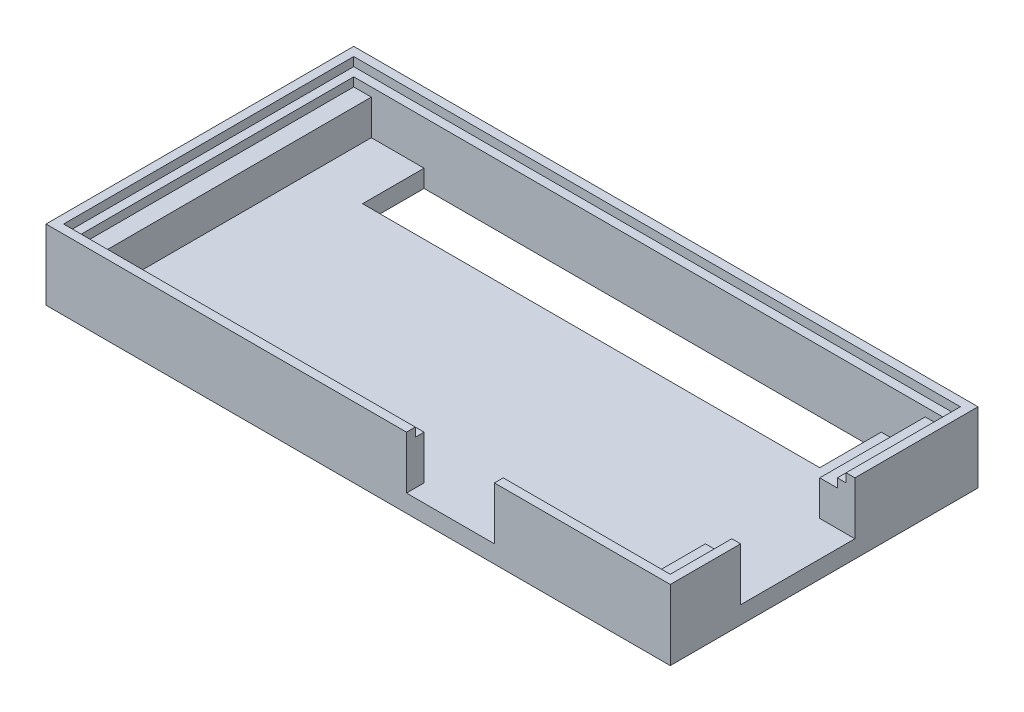
ISO-10303-21;
HEADER;
FILE_DESCRIPTION(('STEP AP214'),'2;1');
FILE_NAME('part.step','',(''),(''),'','','');
FILE_SCHEMA(('AUTOMOTIVE_DESIGN { 1 0 10303 214 1 1 1 1 }'));
ENDSEC;
DATA;
#1=APPLICATION_CONTEXT('core data for automotive mechanical design processes');
#2=APPLICATION_PROTOCOL_DEFINITION('international standard','automotive_design',2000,#1);
#3=PRODUCT_CONTEXT('',#1,'mechanical');
#4=PRODUCT('Part','Part','',(#3));
#5=PRODUCT_RELATED_PRODUCT_CATEGORY('part','',(#4));
#6=PRODUCT_DEFINITION_FORMATION('','',#4);
#7=PRODUCT_DEFINITION_CONTEXT('part definition',#1,'design');
#8=PRODUCT_DEFINITION('design','',#6,#7);
#9=PRODUCT_DEFINITION_SHAPE('','',#8);
#10=(LENGTH_UNIT() NAMED_UNIT(*) SI_UNIT(.MILLI.,.METRE.));
#11=(NAMED_UNIT(*) PLANE_ANGLE_UNIT() SI_UNIT($,.RADIAN.));
#12=(NAMED_UNIT(*) SI_UNIT($,.STERADIAN.) SOLID_ANGLE_UNIT());
#13=UNCERTAINTY_MEASURE_WITH_UNIT(LENGTH_MEASURE(1.E-05),#10,'distance_accuracy_value','');
#14=(GEOMETRIC_REPRESENTATION_CONTEXT(3) GLOBAL_UNCERTAINTY_ASSIGNED_CONTEXT((#13)) GLOBAL_UNIT_ASSIGNED_CONTEXT((#10,
#11,#12)) REPRESENTATION_CONTEXT('',''));
#15=CARTESIAN_POINT('',(0.,0.,0.));
#16=DIRECTION('',(0.,0.,1.));
#17=DIRECTION('',(1.,0.,0.));
#18=AXIS2_PLACEMENT_3D('',#15,#16,#17);
#19=CARTESIAN_POINT('',(0.,7.,0.));
#20=DIRECTION('',(0.,1.,0.));
#21=DIRECTION('',(0.,0.,1.));
#22=AXIS2_PLACEMENT_3D('',#19,#20,#21);
#23=PLANE('',#22);
#24=DIRECTION('',(-1.,0.,0.));
#25=VECTOR('',#24,1.);
#26=CARTESIAN_POINT('',(51.,7.,-1.));
#27=LINE('',#26,#25);
#28=CARTESIAN_POINT('',(70.,7.,-1.));
#29=VERTEX_POINT('',#28);
#30=CARTESIAN_POINT('',(51.,7.,-1.));
#31=VERTEX_POINT('',#30);
#32=EDGE_CURVE('E282',#29,#31,#27,.T.);
#33=ORIENTED_EDGE('',*,*,#32,.F.);
#34=DIRECTION('',(0.,0.,1.));
#35=VECTOR('',#34,1.);
#36=CARTESIAN_POINT('',(70.,7.,-1.));
#37=LINE('',#36,#35);
#38=CARTESIAN_POINT('',(70.,7.,-8.));
#39=VERTEX_POINT('',#38);
#40=EDGE_CURVE('E284',#39,#29,#37,.T.);
#41=ORIENTED_EDGE('',*,*,#40,.F.);
#42=DIRECTION('',(-1.,0.,0.));
#43=VECTOR('',#42,1.);
#44=CARTESIAN_POINT('',(71.,7.,-8.));
#45=LINE('',#44,#43);
#46=CARTESIAN_POINT('',(69.,7.,-8.));
#47=VERTEX_POINT('',#46);
#48=EDGE_CURVE('E373',#39,#47,#45,.T.);
#49=ORIENTED_EDGE('',*,*,#48,.T.);
#50=DIRECTION('',(0.,0.,-1.));
#51=VECTOR('',#50,1.);
#52=CARTESIAN_POINT('',(69.,7.,-2.));
#53=LINE('',#52,#51);
#54=CARTESIAN_POINT('',(69.,7.,-2.));
#55=VERTEX_POINT('',#54);
#56=EDGE_CURVE('E526',#55,#47,#53,.T.);
#57=ORIENTED_EDGE('',*,*,#56,.F.);
#58=DIRECTION('',(1.,0.,0.));
#59=VECTOR('',#58,1.);
#60=CARTESIAN_POINT('',(2.,7.,-2.));
#61=LINE('',#60,#59);
#62=CARTESIAN_POINT('',(51.,7.,-2.));
#63=VERTEX_POINT('',#62);
#64=EDGE_CURVE('E532',#63,#55,#61,.T.);
#65=ORIENTED_EDGE('',*,*,#64,.F.);
#66=DIRECTION('',(0.,0.,-1.));
#67=VECTOR('',#66,1.);
#68=CARTESIAN_POINT('',(51.,7.,0.));
#69=LINE('',#68,#67);
#70=EDGE_CURVE('E353',#31,#63,#69,.T.);
#71=ORIENTED_EDGE('',*,*,#70,.F.);
#72=EDGE_LOOP('',(#33,#41,#49,#57,#65,#71));
#73=FACE_BOUND('',#72,.T.);
#74=ADVANCED_FACE('F32',(#73),#23,.T.);
#75=DIRECTION('',(0.,0.,-1.));
#76=VECTOR('',#75,1.);
#77=CARTESIAN_POINT('',(1.,7.,-34.));
#78=LINE('',#77,#76);
#79=CARTESIAN_POINT('',(1.,7.,-1.));
#80=VERTEX_POINT('',#79);
#81=CARTESIAN_POINT('',(1.,7.,-34.));
#82=VERTEX_POINT('',#81);
#83=EDGE_CURVE('E58',#80,#82,#78,.T.);
#84=ORIENTED_EDGE('',*,*,#83,.F.);
#85=DIRECTION('',(-1.,0.,0.));
#86=VECTOR('',#85,1.);
#87=CARTESIAN_POINT('',(1.,7.,-1.));
#88=LINE('',#87,#86);
#89=CARTESIAN_POINT('',(41.,7.,-1.));
#90=VERTEX_POINT('',#89);
#91=EDGE_CURVE('E300',#90,#80,#88,.T.);
#92=ORIENTED_EDGE('',*,*,#91,.F.);
#93=DIRECTION('',(0.,0.,-1.));
#94=VECTOR('',#93,1.);
#95=CARTESIAN_POINT('',(41.,7.,0.));
#96=LINE('',#95,#94);
#97=CARTESIAN_POINT('',(41.,7.,-2.));
#98=VERTEX_POINT('',#97);
#99=EDGE_CURVE('E357',#90,#98,#96,.T.);
#100=ORIENTED_EDGE('',*,*,#99,.T.);
#101=CARTESIAN_POINT('',(2.,7.,-2.));
#102=VERTEX_POINT('',#101);
#103=EDGE_CURVE('E467',#102,#98,#61,.T.);
#104=ORIENTED_EDGE('',*,*,#103,.F.);
#105=DIRECTION('',(0.,0.,1.));
#106=VECTOR('',#105,1.);
#107=CARTESIAN_POINT('',(2.,7.,-33.));
#108=LINE('',#107,#106);
#109=CARTESIAN_POINT('',(2.,7.,-33.));
#110=VERTEX_POINT('',#109);
#111=EDGE_CURVE('E530',#110,#102,#108,.T.);
#112=ORIENTED_EDGE('',*,*,#111,.F.);
#113=DIRECTION('',(-1.,0.,0.));
#114=VECTOR('',#113,1.);
#115=CARTESIAN_POINT('',(69.,7.,-33.));
#116=LINE('',#115,#114);
#117=CARTESIAN_POINT('',(69.,7.,-33.));
#118=VERTEX_POINT('',#117);
#119=EDGE_CURVE('E529',#118,#110,#116,.T.);
#120=ORIENTED_EDGE('',*,*,#119,.F.);
#121=CARTESIAN_POINT('',(69.,7.,-21.));
#122=VERTEX_POINT('',#121);
#123=EDGE_CURVE('E473',#122,#118,#53,.T.);
#124=ORIENTED_EDGE('',*,*,#123,.F.);
#125=DIRECTION('',(-1.,0.,0.));
#126=VECTOR('',#125,1.);
#127=CARTESIAN_POINT('',(71.,7.,-21.));
#128=LINE('',#127,#126);
#129=CARTESIAN_POINT('',(70.,7.,-21.));
#130=VERTEX_POINT('',#129);
#131=EDGE_CURVE('E377',#130,#122,#128,.T.);
#132=ORIENTED_EDGE('',*,*,#131,.F.);
#133=DIRECTION('',(0.,0.,1.));
#134=VECTOR('',#133,1.);
#135=CARTESIAN_POINT('',(70.,7.,-21.));
#136=LINE('',#135,#134);
#137=CARTESIAN_POINT('',(70.,7.,-34.));
#138=VERTEX_POINT('',#137);
#139=EDGE_CURVE('E305',#138,#130,#136,.T.);
#140=ORIENTED_EDGE('',*,*,#139,.F.);
#141=DIRECTION('',(1.,0.,0.));
#142=VECTOR('',#141,1.);
#143=CARTESIAN_POINT('',(70.,7.,-34.));
#144=LINE('',#143,#142);
#145=EDGE_CURVE('E330',#82,#138,#144,.T.);
#146=ORIENTED_EDGE('',*,*,#145,.F.);
#147=EDGE_LOOP('',(#84,#92,#100,#104,#112,#120,#124,#132,#140,#146));
#148=FACE_BOUND('',#147,.T.);
#149=ADVANCED_FACE('F547',(#148),#23,.T.);
#150=CARTESIAN_POINT('',(2.,7.,-2.));
#151=DIRECTION('',(0.,0.,-1.));
#152=DIRECTION('',(-1.,0.,0.));
#153=AXIS2_PLACEMENT_3D('',#150,#151,#152);
#154=PLANE('',#153);
#155=DIRECTION('',(0.,1.,0.));
#156=VECTOR('',#155,1.);
#157=CARTESIAN_POINT('',(41.,2.,-2.));
#158=LINE('',#157,#156);
#159=CARTESIAN_POINT('',(41.,2.,-2.));
#160=VERTEX_POINT('',#159);
#161=EDGE_CURVE('E267',#160,#98,#158,.T.);
#162=ORIENTED_EDGE('',*,*,#161,.F.);
#163=DIRECTION('',(1.,0.,0.));
#164=VECTOR('',#163,1.);
#165=CARTESIAN_POINT('',(2.,2.,-2.));
#166=LINE('',#165,#164);
#167=CARTESIAN_POINT('',(4.,2.,-2.));
#168=VERTEX_POINT('',#167);
#169=EDGE_CURVE('E469',#168,#160,#166,.T.);
#170=ORIENTED_EDGE('',*,*,#169,.F.);
#171=DIRECTION('',(0.,-1.,0.));
#172=VECTOR('',#171,1.);
#173=CARTESIAN_POINT('',(4.,6.,-2.));
#174=LINE('',#173,#172);
#175=CARTESIAN_POINT('',(4.,6.,-2.));
#176=VERTEX_POINT('',#175);
#177=EDGE_CURVE('E436',#176,#168,#174,.T.);
#178=ORIENTED_EDGE('',*,*,#177,.F.);
#179=DIRECTION('',(1.,0.,0.));
#180=VECTOR('',#179,1.);
#181=CARTESIAN_POINT('',(4.,6.,-2.));
#182=LINE('',#181,#180);
#183=CARTESIAN_POINT('',(2.,6.,-2.));
#184=VERTEX_POINT('',#183);
#185=EDGE_CURVE('E426',#184,#176,#182,.T.);
#186=ORIENTED_EDGE('',*,*,#185,.F.);
#187=DIRECTION('',(0.,-1.,0.));
#188=VECTOR('',#187,1.);
#189=CARTESIAN_POINT('',(2.,7.,-2.));
#190=LINE('',#189,#188);
#191=EDGE_CURVE('E478',#102,#184,#190,.T.);
#192=ORIENTED_EDGE('',*,*,#191,.F.);
#193=ORIENTED_EDGE('',*,*,#103,.T.);
#194=EDGE_LOOP('',(#162,#170,#178,#186,#192,#193));
#195=FACE_BOUND('',#194,.T.);
#196=ADVANCED_FACE('F544',(#195),#154,.T.);
#197=CARTESIAN_POINT('',(69.,7.,-2.));
#198=DIRECTION('',(-1.,0.,0.));
#199=DIRECTION('',(0.,0.,1.));
#200=AXIS2_PLACEMENT_3D('',#197,#198,#199);
#201=PLANE('',#200);
#202=DIRECTION('',(0.,-1.,0.));
#203=VECTOR('',#202,1.);
#204=CARTESIAN_POINT('',(69.,2.,-21.));
#205=LINE('',#204,#203);
#206=CARTESIAN_POINT('',(69.,6.,-21.));
#207=VERTEX_POINT('',#206);
#208=EDGE_CURVE('E368',#122,#207,#205,.T.);
#209=ORIENTED_EDGE('',*,*,#208,.F.);
#210=ORIENTED_EDGE('',*,*,#123,.T.);
#211=DIRECTION('',(0.,-1.,0.));
#212=VECTOR('',#211,1.);
#213=CARTESIAN_POINT('',(69.,7.,-33.));
#214=LINE('',#213,#212);
#215=CARTESIAN_POINT('',(69.,6.,-33.));
#216=VERTEX_POINT('',#215);
#217=EDGE_CURVE('E484',#118,#216,#214,.T.);
#218=ORIENTED_EDGE('',*,*,#217,.T.);
#219=DIRECTION('',(0.,0.,-1.));
#220=VECTOR('',#219,1.);
#221=CARTESIAN_POINT('',(69.,6.,-21.));
#222=LINE('',#221,#220);
#223=EDGE_CURVE('E402',#207,#216,#222,.T.);
#224=ORIENTED_EDGE('',*,*,#223,.F.);
#225=EDGE_LOOP('',(#209,#210,#218,#224));
#226=FACE_BOUND('',#225,.T.);
#227=ADVANCED_FACE('F576',(#226),#201,.T.);
#228=CARTESIAN_POINT('',(0.,2.,0.));
#229=DIRECTION('',(0.,1.,0.));
#230=DIRECTION('',(0.,0.,1.));
#231=AXIS2_PLACEMENT_3D('',#228,#229,#230);
#232=PLANE('',#231);
#233=DIRECTION('',(0.,0.,1.));
#234=VECTOR('',#233,1.);
#235=CARTESIAN_POINT('',(67.,2.,-2.));
#236=LINE('',#235,#234);
#237=CARTESIAN_POINT('',(67.,2.,-8.));
#238=VERTEX_POINT('',#237);
#239=CARTESIAN_POINT('',(67.,2.,-2.));
#240=VERTEX_POINT('',#239);
#241=EDGE_CURVE('E385',#238,#240,#236,.T.);
#242=ORIENTED_EDGE('',*,*,#241,.F.);
#243=DIRECTION('',(-1.,0.,0.));
#244=VECTOR('',#243,1.);
#245=CARTESIAN_POINT('',(67.,2.,-8.));
#246=LINE('',#245,#244);
#247=CARTESIAN_POINT('',(71.,2.,-8.));
#248=VERTEX_POINT('',#247);
#249=EDGE_CURVE('E379',#248,#238,#246,.T.);
#250=ORIENTED_EDGE('',*,*,#249,.F.);
#251=DIRECTION('',(0.,0.,1.));
#252=VECTOR('',#251,1.);
#253=CARTESIAN_POINT('',(71.,2.,-8.));
#254=LINE('',#253,#252);
#255=CARTESIAN_POINT('',(71.,2.,-21.));
#256=VERTEX_POINT('',#255);
#257=EDGE_CURVE('E364',#256,#248,#254,.T.);
#258=ORIENTED_EDGE('',*,*,#257,.F.);
#259=DIRECTION('',(1.,0.,0.));
#260=VECTOR('',#259,1.);
#261=CARTESIAN_POINT('',(67.,2.,-21.));
#262=LINE('',#261,#260);
#263=CARTESIAN_POINT('',(67.,2.,-21.));
#264=VERTEX_POINT('',#263);
#265=EDGE_CURVE('E406',#264,#256,#262,.T.);
#266=ORIENTED_EDGE('',*,*,#265,.F.);
#267=DIRECTION('',(0.,0.,1.));
#268=VECTOR('',#267,1.);
#269=CARTESIAN_POINT('',(67.,2.,-33.));
#270=LINE('',#269,#268);
#271=CARTESIAN_POINT('',(67.,2.,-33.));
#272=VERTEX_POINT('',#271);
#273=EDGE_CURVE('E401',#272,#264,#270,.T.);
#274=ORIENTED_EDGE('',*,*,#273,.F.);
#275=DIRECTION('',(-1.,0.,0.));
#276=VECTOR('',#275,1.);
#277=CARTESIAN_POINT('',(69.,2.,-33.));
#278=LINE('',#277,#276);
#279=CARTESIAN_POINT('',(62.,2.,-33.));
#280=VERTEX_POINT('',#279);
#281=EDGE_CURVE('E36',#272,#280,#278,.T.);
#282=ORIENTED_EDGE('',*,*,#281,.T.);
#283=DIRECTION('',(0.,0.,-1.));
#284=VECTOR('',#283,1.);
#285=CARTESIAN_POINT('',(62.,2.,-26.));
#286=LINE('',#285,#284);
#287=CARTESIAN_POINT('',(62.,2.,-26.));
#288=VERTEX_POINT('',#287);
#289=EDGE_CURVE('E450',#288,#280,#286,.T.);
#290=ORIENTED_EDGE('',*,*,#289,.F.);
#291=DIRECTION('',(1.,0.,0.));
#292=VECTOR('',#291,1.);
#293=CARTESIAN_POINT('',(10.,2.,-26.));
#294=LINE('',#293,#292);
#295=CARTESIAN_POINT('',(10.,2.,-26.));
#296=VERTEX_POINT('',#295);
#297=EDGE_CURVE('E441',#296,#288,#294,.T.);
#298=ORIENTED_EDGE('',*,*,#297,.F.);
#299=DIRECTION('',(0.,0.,1.));
#300=VECTOR('',#299,1.);
#301=CARTESIAN_POINT('',(9.99999999999999,2.,-33.));
#302=LINE('',#301,#300);
#303=CARTESIAN_POINT('',(9.99999999999999,2.,-33.));
#304=VERTEX_POINT('',#303);
#305=EDGE_CURVE('E438',#304,#296,#302,.T.);
#306=ORIENTED_EDGE('',*,*,#305,.F.);
#307=CARTESIAN_POINT('',(4.,2.,-33.));
#308=VERTEX_POINT('',#307);
#309=EDGE_CURVE('E460',#304,#308,#278,.T.);
#310=ORIENTED_EDGE('',*,*,#309,.T.);
#311=DIRECTION('',(0.,0.,-1.));
#312=VECTOR('',#311,1.);
#313=CARTESIAN_POINT('',(4.,2.,-33.));
#314=LINE('',#313,#312);
#315=EDGE_CURVE('E423',#168,#308,#314,.T.);
#316=ORIENTED_EDGE('',*,*,#315,.F.);
#317=ORIENTED_EDGE('',*,*,#169,.T.);
#318=DIRECTION('',(0.,0.,-1.));
#319=VECTOR('',#318,1.);
#320=CARTESIAN_POINT('',(41.,2.,0.));
#321=LINE('',#320,#319);
#322=CARTESIAN_POINT('',(41.,2.,0.));
#323=VERTEX_POINT('',#322);
#324=EDGE_CURVE('E360',#323,#160,#321,.T.);
#325=ORIENTED_EDGE('',*,*,#324,.F.);
#326=DIRECTION('',(-1.,0.,0.));
#327=VECTOR('',#326,1.);
#328=CARTESIAN_POINT('',(51.,2.,0.));
#329=LINE('',#328,#327);
#330=CARTESIAN_POINT('',(51.,2.,0.));
#331=VERTEX_POINT('',#330);
#332=EDGE_CURVE('E266',#331,#323,#329,.T.);
#333=ORIENTED_EDGE('',*,*,#332,.F.);
#334=DIRECTION('',(0.,0.,-1.));
#335=VECTOR('',#334,1.);
#336=CARTESIAN_POINT('',(51.,2.,0.));
#337=LINE('',#336,#335);
#338=CARTESIAN_POINT('',(51.,2.,-2.));
#339=VERTEX_POINT('',#338);
#340=EDGE_CURVE('E262',#331,#339,#337,.T.);
#341=ORIENTED_EDGE('',*,*,#340,.T.);
#342=EDGE_CURVE('E474',#339,#240,#166,.T.);
#343=ORIENTED_EDGE('',*,*,#342,.T.);
#344=EDGE_LOOP('',(#242,#250,#258,#266,#274,#282,#290,#298,#306,#310,#316,#317,#325,#333,#341,#343));
#345=FACE_BOUND('',#344,.T.);
#346=ADVANCED_FACE('F556',(#345),#232,.T.);
#347=DIRECTION('',(0.,1.,0.));
#348=VECTOR('',#347,1.);
#349=CARTESIAN_POINT('',(69.,7.,-8.));
#350=LINE('',#349,#348);
#351=CARTESIAN_POINT('',(69.,6.,-8.));
#352=VERTEX_POINT('',#351);
#353=EDGE_CURVE('E359',#352,#47,#350,.T.);
#354=ORIENTED_EDGE('',*,*,#353,.F.);
#355=DIRECTION('',(0.,0.,-1.));
#356=VECTOR('',#355,1.);
#357=CARTESIAN_POINT('',(69.,6.,-8.));
#358=LINE('',#357,#356);
#359=CARTESIAN_POINT('',(69.,6.,-2.));
#360=VERTEX_POINT('',#359);
#361=EDGE_CURVE('E381',#360,#352,#358,.T.);
#362=ORIENTED_EDGE('',*,*,#361,.F.);
#363=DIRECTION('',(0.,-1.,0.));
#364=VECTOR('',#363,1.);
#365=CARTESIAN_POINT('',(69.,7.,-2.));
#366=LINE('',#365,#364);
#367=EDGE_CURVE('E475',#55,#360,#366,.T.);
#368=ORIENTED_EDGE('',*,*,#367,.F.);
#369=ORIENTED_EDGE('',*,*,#56,.T.);
#370=EDGE_LOOP('',(#354,#362,#368,#369));
#371=FACE_BOUND('',#370,.T.);
#372=ADVANCED_FACE('F656',(#371),#201,.T.);
#373=DIRECTION('',(0.,-1.,0.));
#374=VECTOR('',#373,1.);
#375=CARTESIAN_POINT('',(51.,7.,-2.));
#376=LINE('',#375,#374);
#377=EDGE_CURVE('E348',#63,#339,#376,.T.);
#378=ORIENTED_EDGE('',*,*,#377,.F.);
#379=ORIENTED_EDGE('',*,*,#64,.T.);
#380=ORIENTED_EDGE('',*,*,#367,.T.);
#381=DIRECTION('',(1.,0.,0.));
#382=VECTOR('',#381,1.);
#383=CARTESIAN_POINT('',(69.,6.,-2.));
#384=LINE('',#383,#382);
#385=CARTESIAN_POINT('',(67.,6.,-2.));
#386=VERTEX_POINT('',#385);
#387=EDGE_CURVE('E390',#386,#360,#384,.T.);
#388=ORIENTED_EDGE('',*,*,#387,.F.);
#389=DIRECTION('',(0.,-1.,0.));
#390=VECTOR('',#389,1.);
#391=CARTESIAN_POINT('',(67.,6.,-2.));
#392=LINE('',#391,#390);
#393=EDGE_CURVE('E392',#386,#240,#392,.T.);
#394=ORIENTED_EDGE('',*,*,#393,.T.);
#395=ORIENTED_EDGE('',*,*,#342,.F.);
#396=EDGE_LOOP('',(#378,#379,#380,#388,#394,#395));
#397=FACE_BOUND('',#396,.T.);
#398=ADVANCED_FACE('F633',(#397),#154,.T.);
#399=CARTESIAN_POINT('',(69.,7.,-33.));
#400=DIRECTION('',(0.,0.,1.));
#401=DIRECTION('',(1.,0.,0.));
#402=AXIS2_PLACEMENT_3D('',#399,#400,#401);
#403=PLANE('',#402);
#404=ORIENTED_EDGE('',*,*,#281,.F.);
#405=DIRECTION('',(0.,-1.,0.));
#406=VECTOR('',#405,1.);
#407=CARTESIAN_POINT('',(67.,6.,-33.));
#408=LINE('',#407,#406);
#409=CARTESIAN_POINT('',(67.,6.,-33.));
#410=VERTEX_POINT('',#409);
#411=EDGE_CURVE('E420',#410,#272,#408,.T.);
#412=ORIENTED_EDGE('',*,*,#411,.F.);
#413=DIRECTION('',(-1.,0.,0.));
#414=VECTOR('',#413,1.);
#415=CARTESIAN_POINT('',(69.,6.,-33.));
#416=LINE('',#415,#414);
#417=EDGE_CURVE('E405',#216,#410,#416,.T.);
#418=ORIENTED_EDGE('',*,*,#417,.F.);
#419=ORIENTED_EDGE('',*,*,#217,.F.);
#420=ORIENTED_EDGE('',*,*,#119,.T.);
#421=DIRECTION('',(0.,-1.,0.));
#422=VECTOR('',#421,1.);
#423=CARTESIAN_POINT('',(2.,7.,-33.));
#424=LINE('',#423,#422);
#425=CARTESIAN_POINT('',(2.,6.,-33.));
#426=VERTEX_POINT('',#425);
#427=EDGE_CURVE('E481',#110,#426,#424,.T.);
#428=ORIENTED_EDGE('',*,*,#427,.T.);
#429=DIRECTION('',(-1.,0.,0.));
#430=VECTOR('',#429,1.);
#431=CARTESIAN_POINT('',(2.,6.,-33.));
#432=LINE('',#431,#430);
#433=CARTESIAN_POINT('',(4.,6.,-33.));
#434=VERTEX_POINT('',#433);
#435=EDGE_CURVE('E430',#434,#426,#432,.T.);
#436=ORIENTED_EDGE('',*,*,#435,.F.);
#437=DIRECTION('',(0.,-1.,0.));
#438=VECTOR('',#437,1.);
#439=CARTESIAN_POINT('',(4.,6.,-33.));
#440=LINE('',#439,#438);
#441=EDGE_CURVE('E432',#434,#308,#440,.T.);
#442=ORIENTED_EDGE('',*,*,#441,.T.);
#443=ORIENTED_EDGE('',*,*,#309,.F.);
#444=DIRECTION('',(0.,1.,0.));
#445=VECTOR('',#444,1.);
#446=CARTESIAN_POINT('',(9.99999999999999,-3.,-33.));
#447=LINE('',#446,#445);
#448=CARTESIAN_POINT('',(9.99999999999999,0.,-33.));
#449=VERTEX_POINT('',#448);
#450=EDGE_CURVE('E447',#449,#304,#447,.T.);
#451=ORIENTED_EDGE('',*,*,#450,.F.);
#452=DIRECTION('',(-1.,0.,0.));
#453=VECTOR('',#452,1.);
#454=CARTESIAN_POINT('',(0.,0.,-33.));
#455=LINE('',#454,#453);
#456=CARTESIAN_POINT('',(62.,0.,-33.));
#457=VERTEX_POINT('',#456);
#458=EDGE_CURVE('E11',#457,#449,#455,.T.);
#459=ORIENTED_EDGE('',*,*,#458,.F.);
#460=DIRECTION('',(0.,1.,0.));
#461=VECTOR('',#460,1.);
#462=CARTESIAN_POINT('',(62.,-3.,-33.));
#463=LINE('',#462,#461);
#464=EDGE_CURVE('E457',#457,#280,#463,.T.);
#465=ORIENTED_EDGE('',*,*,#464,.T.);
#466=EDGE_LOOP('',(#404,#412,#418,#419,#420,#428,#436,#442,#443,#451,#459,#465));
#467=FACE_BOUND('',#466,.T.);
#468=ADVANCED_FACE('F570',(#467),#403,.T.);
#469=CARTESIAN_POINT('',(2.,7.,-33.));
#470=DIRECTION('',(1.,0.,0.));
#471=DIRECTION('',(0.,0.,-1.));
#472=AXIS2_PLACEMENT_3D('',#469,#470,#471);
#473=PLANE('',#472);
#474=ORIENTED_EDGE('',*,*,#191,.T.);
#475=DIRECTION('',(0.,0.,1.));
#476=VECTOR('',#475,1.);
#477=CARTESIAN_POINT('',(2.,6.,-2.));
#478=LINE('',#477,#476);
#479=EDGE_CURVE('E424',#426,#184,#478,.T.);
#480=ORIENTED_EDGE('',*,*,#479,.F.);
#481=ORIENTED_EDGE('',*,*,#427,.F.);
#482=ORIENTED_EDGE('',*,*,#111,.T.);
#483=EDGE_LOOP('',(#474,#480,#481,#482));
#484=FACE_BOUND('',#483,.T.);
#485=ADVANCED_FACE('F567',(#484),#473,.T.);
#486=CARTESIAN_POINT('',(0.,2.,-35.));
#487=DIRECTION('',(1.,0.,0.));
#488=DIRECTION('',(0.,0.,-1.));
#489=AXIS2_PLACEMENT_3D('',#486,#487,#488);
#490=PLANE('',#489);
#491=DIRECTION('',(0.,0.,1.));
#492=VECTOR('',#491,1.);
#493=CARTESIAN_POINT('',(0.,0.,-35.));
#494=LINE('',#493,#492);
#495=CARTESIAN_POINT('',(0.,0.,-35.));
#496=VERTEX_POINT('',#495);
#497=CARTESIAN_POINT('',(0.,0.,0.));
#498=VERTEX_POINT('',#497);
#499=EDGE_CURVE('E486',#496,#498,#494,.T.);
#500=ORIENTED_EDGE('',*,*,#499,.T.);
#501=DIRECTION('',(0.,-1.,0.));
#502=VECTOR('',#501,1.);
#503=CARTESIAN_POINT('',(0.,2.,0.));
#504=LINE('',#503,#502);
#505=CARTESIAN_POINT('',(0.,8.,0.));
#506=VERTEX_POINT('',#505);
#507=EDGE_CURVE('E502',#506,#498,#504,.T.);
#508=ORIENTED_EDGE('',*,*,#507,.F.);
#509=DIRECTION('',(0.,0.,1.));
#510=VECTOR('',#509,1.);
#511=CARTESIAN_POINT('',(0.,8.,-35.));
#512=LINE('',#511,#510);
#513=CARTESIAN_POINT('',(0.,8.,-35.));
#514=VERTEX_POINT('',#513);
#515=EDGE_CURVE('E308',#514,#506,#512,.T.);
#516=ORIENTED_EDGE('',*,*,#515,.F.);
#517=DIRECTION('',(0.,-1.,0.));
#518=VECTOR('',#517,1.);
#519=CARTESIAN_POINT('',(0.,2.,-35.));
#520=LINE('',#519,#518);
#521=EDGE_CURVE('E495',#514,#496,#520,.T.);
#522=ORIENTED_EDGE('',*,*,#521,.T.);
#523=EDGE_LOOP('',(#500,#508,#516,#522));
#524=FACE_BOUND('',#523,.T.);
#525=ADVANCED_FACE('F34',(#524),#490,.F.);
#526=CARTESIAN_POINT('',(0.,2.,0.));
#527=DIRECTION('',(0.,0.,-1.));
#528=DIRECTION('',(-1.,0.,0.));
#529=AXIS2_PLACEMENT_3D('',#526,#527,#528);
#530=PLANE('',#529);
#531=ORIENTED_EDGE('',*,*,#332,.T.);
#532=DIRECTION('',(0.,1.,0.));
#533=VECTOR('',#532,1.);
#534=CARTESIAN_POINT('',(41.,2.,0.));
#535=LINE('',#534,#533);
#536=CARTESIAN_POINT('',(41.,8.,0.));
#537=VERTEX_POINT('',#536);
#538=EDGE_CURVE('E351',#323,#537,#535,.T.);
#539=ORIENTED_EDGE('',*,*,#538,.T.);
#540=DIRECTION('',(1.,0.,0.));
#541=VECTOR('',#540,1.);
#542=CARTESIAN_POINT('',(0.,8.,0.));
#543=LINE('',#542,#541);
#544=EDGE_CURVE('E311',#506,#537,#543,.T.);
#545=ORIENTED_EDGE('',*,*,#544,.F.);
#546=ORIENTED_EDGE('',*,*,#507,.T.);
#547=DIRECTION('',(1.,0.,0.));
#548=VECTOR('',#547,1.);
#549=CARTESIAN_POINT('',(0.,0.,0.));
#550=LINE('',#549,#548);
#551=CARTESIAN_POINT('',(71.,0.,0.));
#552=VERTEX_POINT('',#551);
#553=EDGE_CURVE('E489',#498,#552,#550,.T.);
#554=ORIENTED_EDGE('',*,*,#553,.T.);
#555=DIRECTION('',(0.,-1.,0.));
#556=VECTOR('',#555,1.);
#557=CARTESIAN_POINT('',(71.,2.,0.));
#558=LINE('',#557,#556);
#559=CARTESIAN_POINT('',(71.,8.,0.));
#560=VERTEX_POINT('',#559);
#561=EDGE_CURVE('E273',#560,#552,#558,.T.);
#562=ORIENTED_EDGE('',*,*,#561,.F.);
#563=DIRECTION('',(1.,0.,0.));
#564=VECTOR('',#563,1.);
#565=CARTESIAN_POINT('',(51.,8.,0.));
#566=LINE('',#565,#564);
#567=CARTESIAN_POINT('',(51.,8.,0.));
#568=VERTEX_POINT('',#567);
#569=EDGE_CURVE('E270',#568,#560,#566,.T.);
#570=ORIENTED_EDGE('',*,*,#569,.F.);
#571=DIRECTION('',(0.,-1.,0.));
#572=VECTOR('',#571,1.);
#573=CARTESIAN_POINT('',(51.,7.,0.));
#574=LINE('',#573,#572);
#575=EDGE_CURVE('E256',#568,#331,#574,.T.);
#576=ORIENTED_EDGE('',*,*,#575,.T.);
#577=EDGE_LOOP('',(#531,#539,#545,#546,#554,#562,#570,#576));
#578=FACE_BOUND('',#577,.T.);
#579=ADVANCED_FACE('F271',(#578),#530,.F.);
#580=CARTESIAN_POINT('',(71.,2.,0.));
#581=DIRECTION('',(-1.,0.,0.));
#582=DIRECTION('',(0.,0.,1.));
#583=AXIS2_PLACEMENT_3D('',#580,#581,#582);
#584=PLANE('',#583);
#585=DIRECTION('',(0.,-1.,0.));
#586=VECTOR('',#585,1.);
#587=CARTESIAN_POINT('',(71.,2.,-35.));
#588=LINE('',#587,#586);
#589=CARTESIAN_POINT('',(71.,8.,-35.));
#590=VERTEX_POINT('',#589);
#591=CARTESIAN_POINT('',(71.,0.,-35.));
#592=VERTEX_POINT('',#591);
#593=EDGE_CURVE('E498',#590,#592,#588,.T.);
#594=ORIENTED_EDGE('',*,*,#593,.F.);
#595=DIRECTION('',(0.,0.,-1.));
#596=VECTOR('',#595,1.);
#597=CARTESIAN_POINT('',(71.,8.,-21.));
#598=LINE('',#597,#596);
#599=CARTESIAN_POINT('',(71.,8.,-21.));
#600=VERTEX_POINT('',#599);
#601=EDGE_CURVE('E301',#600,#590,#598,.T.);
#602=ORIENTED_EDGE('',*,*,#601,.F.);
#603=DIRECTION('',(0.,-1.,0.));
#604=VECTOR('',#603,1.);
#605=CARTESIAN_POINT('',(71.,2.,-21.));
#606=LINE('',#605,#604);
#607=EDGE_CURVE('E370',#600,#256,#606,.T.);
#608=ORIENTED_EDGE('',*,*,#607,.T.);
#609=ORIENTED_EDGE('',*,*,#257,.T.);
#610=DIRECTION('',(0.,1.,0.));
#611=VECTOR('',#610,1.);
#612=CARTESIAN_POINT('',(71.,7.,-8.));
#613=LINE('',#612,#611);
#614=CARTESIAN_POINT('',(71.,8.,-8.));
#615=VERTEX_POINT('',#614);
#616=EDGE_CURVE('E367',#248,#615,#613,.T.);
#617=ORIENTED_EDGE('',*,*,#616,.T.);
#618=DIRECTION('',(0.,0.,-1.));
#619=VECTOR('',#618,1.);
#620=CARTESIAN_POINT('',(71.,8.,0.));
#621=LINE('',#620,#619);
#622=EDGE_CURVE('E277',#560,#615,#621,.T.);
#623=ORIENTED_EDGE('',*,*,#622,.F.);
#624=ORIENTED_EDGE('',*,*,#561,.T.);
#625=DIRECTION('',(0.,0.,-1.));
#626=VECTOR('',#625,1.);
#627=CARTESIAN_POINT('',(71.,0.,0.));
#628=LINE('',#627,#626);
#629=EDGE_CURVE('E491',#552,#592,#628,.T.);
#630=ORIENTED_EDGE('',*,*,#629,.T.);
#631=EDGE_LOOP('',(#594,#602,#608,#609,#617,#623,#624,#630));
#632=FACE_BOUND('',#631,.T.);
#633=ADVANCED_FACE('F607',(#632),#584,.F.);
#634=CARTESIAN_POINT('',(71.,2.,-35.));
#635=DIRECTION('',(0.,0.,1.));
#636=DIRECTION('',(1.,0.,0.));
#637=AXIS2_PLACEMENT_3D('',#634,#635,#636);
#638=PLANE('',#637);
#639=DIRECTION('',(-1.,0.,0.));
#640=VECTOR('',#639,1.);
#641=CARTESIAN_POINT('',(71.,0.,-35.));
#642=LINE('',#641,#640);
#643=EDGE_CURVE('E493',#592,#496,#642,.T.);
#644=ORIENTED_EDGE('',*,*,#643,.T.);
#645=ORIENTED_EDGE('',*,*,#521,.F.);
#646=DIRECTION('',(-1.,0.,0.));
#647=VECTOR('',#646,1.);
#648=CARTESIAN_POINT('',(71.,8.,-35.));
#649=LINE('',#648,#647);
#650=EDGE_CURVE('E304',#590,#514,#649,.T.);
#651=ORIENTED_EDGE('',*,*,#650,.F.);
#652=ORIENTED_EDGE('',*,*,#593,.T.);
#653=EDGE_LOOP('',(#644,#645,#651,#652));
#654=FACE_BOUND('',#653,.T.);
#655=ADVANCED_FACE('F611',(#654),#638,.F.);
#656=CARTESIAN_POINT('',(0.,0.,0.));
#657=DIRECTION('',(0.,1.,0.));
#658=DIRECTION('',(0.,0.,1.));
#659=AXIS2_PLACEMENT_3D('',#656,#657,#658);
#660=PLANE('',#659);
#661=DIRECTION('',(0.,0.,-1.));
#662=VECTOR('',#661,1.);
#663=CARTESIAN_POINT('',(62.,0.,0.));
#664=LINE('',#663,#662);
#665=CARTESIAN_POINT('',(62.,0.,-26.));
#666=VERTEX_POINT('',#665);
#667=EDGE_CURVE('E42',#666,#457,#664,.T.);
#668=ORIENTED_EDGE('',*,*,#667,.T.);
#669=ORIENTED_EDGE('',*,*,#458,.T.);
#670=DIRECTION('',(0.,0.,1.));
#671=VECTOR('',#670,1.);
#672=CARTESIAN_POINT('',(10.,0.,0.));
#673=LINE('',#672,#671);
#674=CARTESIAN_POINT('',(10.,0.,-26.));
#675=VERTEX_POINT('',#674);
#676=EDGE_CURVE('E505',#449,#675,#673,.T.);
#677=ORIENTED_EDGE('',*,*,#676,.T.);
#678=DIRECTION('',(1.,0.,0.));
#679=VECTOR('',#678,1.);
#680=CARTESIAN_POINT('',(0.,0.,-26.));
#681=LINE('',#680,#679);
#682=EDGE_CURVE('E508',#675,#666,#681,.T.);
#683=ORIENTED_EDGE('',*,*,#682,.T.);
#684=EDGE_LOOP('',(#668,#669,#677,#683));
#685=FACE_BOUND('',#684,.T.);
#686=ORIENTED_EDGE('',*,*,#499,.F.);
#687=ORIENTED_EDGE('',*,*,#643,.F.);
#688=ORIENTED_EDGE('',*,*,#629,.F.);
#689=ORIENTED_EDGE('',*,*,#553,.F.);
#690=EDGE_LOOP('',(#686,#687,#688,#689));
#691=FACE_BOUND('',#690,.T.);
#692=ADVANCED_FACE('F512',(#685,#691),#660,.F.);
#693=CARTESIAN_POINT('',(62.,-3.,-26.));
#694=DIRECTION('',(1.,0.,0.));
#695=DIRECTION('',(0.,0.,-1.));
#696=AXIS2_PLACEMENT_3D('',#693,#694,#695);
#697=PLANE('',#696);
#698=DIRECTION('',(0.,1.,0.));
#699=VECTOR('',#698,1.);
#700=CARTESIAN_POINT('',(62.,-3.,-26.));
#701=LINE('',#700,#699);
#702=EDGE_CURVE('E461',#666,#288,#701,.T.);
#703=ORIENTED_EDGE('',*,*,#702,.T.);
#704=ORIENTED_EDGE('',*,*,#289,.T.);
#705=ORIENTED_EDGE('',*,*,#464,.F.);
#706=ORIENTED_EDGE('',*,*,#667,.F.);
#707=EDGE_LOOP('',(#703,#704,#705,#706));
#708=FACE_BOUND('',#707,.T.);
#709=ADVANCED_FACE('F519',(#708),#697,.F.);
#710=CARTESIAN_POINT('',(10.,-3.,-26.));
#711=DIRECTION('',(0.,0.,1.));
#712=DIRECTION('',(1.,0.,0.));
#713=AXIS2_PLACEMENT_3D('',#710,#711,#712);
#714=PLANE('',#713);
#715=DIRECTION('',(0.,1.,0.));
#716=VECTOR('',#715,1.);
#717=CARTESIAN_POINT('',(10.,-3.,-26.));
#718=LINE('',#717,#716);
#719=EDGE_CURVE('E449',#675,#296,#718,.T.);
#720=ORIENTED_EDGE('',*,*,#719,.T.);
#721=ORIENTED_EDGE('',*,*,#297,.T.);
#722=ORIENTED_EDGE('',*,*,#702,.F.);
#723=ORIENTED_EDGE('',*,*,#682,.F.);
#724=EDGE_LOOP('',(#720,#721,#722,#723));
#725=FACE_BOUND('',#724,.T.);
#726=ADVANCED_FACE('F522',(#725),#714,.F.);
#727=CARTESIAN_POINT('',(9.99999999999999,-3.,-33.));
#728=DIRECTION('',(-1.,0.,0.));
#729=DIRECTION('',(0.,0.,1.));
#730=AXIS2_PLACEMENT_3D('',#727,#728,#729);
#731=PLANE('',#730);
#732=ORIENTED_EDGE('',*,*,#450,.T.);
#733=ORIENTED_EDGE('',*,*,#305,.T.);
#734=ORIENTED_EDGE('',*,*,#719,.F.);
#735=ORIENTED_EDGE('',*,*,#676,.F.);
#736=EDGE_LOOP('',(#732,#733,#734,#735));
#737=FACE_BOUND('',#736,.T.);
#738=ADVANCED_FACE('F639',(#737),#731,.F.);
#739=CARTESIAN_POINT('',(4.,6.,-33.));
#740=DIRECTION('',(-1.,0.,0.));
#741=DIRECTION('',(0.,0.,1.));
#742=AXIS2_PLACEMENT_3D('',#739,#740,#741);
#743=PLANE('',#742);
#744=ORIENTED_EDGE('',*,*,#315,.T.);
#745=ORIENTED_EDGE('',*,*,#441,.F.);
#746=DIRECTION('',(0.,0.,-1.));
#747=VECTOR('',#746,1.);
#748=CARTESIAN_POINT('',(4.,6.,-33.));
#749=LINE('',#748,#747);
#750=EDGE_CURVE('E428',#176,#434,#749,.T.);
#751=ORIENTED_EDGE('',*,*,#750,.F.);
#752=ORIENTED_EDGE('',*,*,#177,.T.);
#753=EDGE_LOOP('',(#744,#745,#751,#752));
#754=FACE_BOUND('',#753,.T.);
#755=ADVANCED_FACE('F561',(#754),#743,.F.);
#756=CARTESIAN_POINT('',(0.,6.,0.));
#757=DIRECTION('',(0.,-1.,0.));
#758=DIRECTION('',(0.,0.,-1.));
#759=AXIS2_PLACEMENT_3D('',#756,#757,#758);
#760=PLANE('',#759);
#761=ORIENTED_EDGE('',*,*,#479,.T.);
#762=ORIENTED_EDGE('',*,*,#185,.T.);
#763=ORIENTED_EDGE('',*,*,#750,.T.);
#764=ORIENTED_EDGE('',*,*,#435,.T.);
#765=EDGE_LOOP('',(#761,#762,#763,#764));
#766=FACE_BOUND('',#765,.T.);
#767=ADVANCED_FACE('F565',(#766),#760,.F.);
#768=CARTESIAN_POINT('',(67.,6.,-33.));
#769=DIRECTION('',(1.,0.,0.));
#770=DIRECTION('',(0.,0.,-1.));
#771=AXIS2_PLACEMENT_3D('',#768,#769,#770);
#772=PLANE('',#771);
#773=ORIENTED_EDGE('',*,*,#273,.T.);
#774=DIRECTION('',(0.,-1.,0.));
#775=VECTOR('',#774,1.);
#776=CARTESIAN_POINT('',(67.,6.,-21.));
#777=LINE('',#776,#775);
#778=CARTESIAN_POINT('',(67.,6.,-21.));
#779=VERTEX_POINT('',#778);
#780=EDGE_CURVE('E414',#779,#264,#777,.T.);
#781=ORIENTED_EDGE('',*,*,#780,.F.);
#782=DIRECTION('',(0.,0.,1.));
#783=VECTOR('',#782,1.);
#784=CARTESIAN_POINT('',(67.,6.,-33.));
#785=LINE('',#784,#783);
#786=EDGE_CURVE('E409',#410,#779,#785,.T.);
#787=ORIENTED_EDGE('',*,*,#786,.F.);
#788=ORIENTED_EDGE('',*,*,#411,.T.);
#789=EDGE_LOOP('',(#773,#781,#787,#788));
#790=FACE_BOUND('',#789,.T.);
#791=ADVANCED_FACE('F817',(#790),#772,.F.);
#792=CARTESIAN_POINT('',(67.,6.,-21.));
#793=DIRECTION('',(0.,0.,-1.));
#794=DIRECTION('',(-1.,0.,0.));
#795=AXIS2_PLACEMENT_3D('',#792,#793,#794);
#796=PLANE('',#795);
#797=ORIENTED_EDGE('',*,*,#265,.T.);
#798=ORIENTED_EDGE('',*,*,#607,.F.);
#799=DIRECTION('',(1.,0.,0.));
#800=VECTOR('',#799,1.);
#801=CARTESIAN_POINT('',(70.,8.,-21.));
#802=LINE('',#801,#800);
#803=CARTESIAN_POINT('',(70.,8.,-21.));
#804=VERTEX_POINT('',#803);
#805=EDGE_CURVE('E324',#804,#600,#802,.T.);
#806=ORIENTED_EDGE('',*,*,#805,.F.);
#807=DIRECTION('',(0.,-1.,0.));
#808=VECTOR('',#807,1.);
#809=CARTESIAN_POINT('',(70.,8.,-21.));
#810=LINE('',#809,#808);
#811=EDGE_CURVE('E327',#804,#130,#810,.T.);
#812=ORIENTED_EDGE('',*,*,#811,.T.);
#813=ORIENTED_EDGE('',*,*,#131,.T.);
#814=ORIENTED_EDGE('',*,*,#208,.T.);
#815=DIRECTION('',(1.,0.,0.));
#816=VECTOR('',#815,1.);
#817=CARTESIAN_POINT('',(67.,6.,-21.));
#818=LINE('',#817,#816);
#819=EDGE_CURVE('E411',#779,#207,#818,.T.);
#820=ORIENTED_EDGE('',*,*,#819,.F.);
#821=ORIENTED_EDGE('',*,*,#780,.T.);
#822=EDGE_LOOP('',(#797,#798,#806,#812,#813,#814,#820,#821));
#823=FACE_BOUND('',#822,.T.);
#824=ADVANCED_FACE('F580',(#823),#796,.F.);
#825=CARTESIAN_POINT('',(0.,6.,0.));
#826=DIRECTION('',(0.,1.,0.));
#827=DIRECTION('',(0.,0.,1.));
#828=AXIS2_PLACEMENT_3D('',#825,#826,#827);
#829=PLANE('',#828);
#830=ORIENTED_EDGE('',*,*,#223,.T.);
#831=ORIENTED_EDGE('',*,*,#417,.T.);
#832=ORIENTED_EDGE('',*,*,#786,.T.);
#833=ORIENTED_EDGE('',*,*,#819,.T.);
#834=EDGE_LOOP('',(#830,#831,#832,#833));
#835=FACE_BOUND('',#834,.T.);
#836=ADVANCED_FACE('F703',(#835),#829,.T.);
#837=CARTESIAN_POINT('',(67.,6.,-8.));
#838=DIRECTION('',(0.,0.,1.));
#839=DIRECTION('',(1.,0.,0.));
#840=AXIS2_PLACEMENT_3D('',#837,#838,#839);
#841=PLANE('',#840);
#842=ORIENTED_EDGE('',*,*,#249,.T.);
#843=DIRECTION('',(0.,-1.,0.));
#844=VECTOR('',#843,1.);
#845=CARTESIAN_POINT('',(67.,6.,-8.));
#846=LINE('',#845,#844);
#847=CARTESIAN_POINT('',(67.,6.,-8.));
#848=VERTEX_POINT('',#847);
#849=EDGE_CURVE('E398',#848,#238,#846,.T.);
#850=ORIENTED_EDGE('',*,*,#849,.F.);
#851=DIRECTION('',(-1.,0.,0.));
#852=VECTOR('',#851,1.);
#853=CARTESIAN_POINT('',(67.,6.,-8.));
#854=LINE('',#853,#852);
#855=EDGE_CURVE('E384',#352,#848,#854,.T.);
#856=ORIENTED_EDGE('',*,*,#855,.F.);
#857=ORIENTED_EDGE('',*,*,#353,.T.);
#858=ORIENTED_EDGE('',*,*,#48,.F.);
#859=DIRECTION('',(0.,-1.,0.));
#860=VECTOR('',#859,1.);
#861=CARTESIAN_POINT('',(70.,8.,-8.));
#862=LINE('',#861,#860);
#863=CARTESIAN_POINT('',(70.,8.,-8.));
#864=VERTEX_POINT('',#863);
#865=EDGE_CURVE('E298',#864,#39,#862,.T.);
#866=ORIENTED_EDGE('',*,*,#865,.F.);
#867=DIRECTION('',(-1.,0.,0.));
#868=VECTOR('',#867,1.);
#869=CARTESIAN_POINT('',(70.,8.,-8.));
#870=LINE('',#869,#868);
#871=EDGE_CURVE('E288',#615,#864,#870,.T.);
#872=ORIENTED_EDGE('',*,*,#871,.F.);
#873=ORIENTED_EDGE('',*,*,#616,.F.);
#874=EDGE_LOOP('',(#842,#850,#856,#857,#858,#866,#872,#873));
#875=FACE_BOUND('',#874,.T.);
#876=ADVANCED_FACE('F618',(#875),#841,.F.);
#877=CARTESIAN_POINT('',(67.,6.,-2.));
#878=DIRECTION('',(1.,0.,0.));
#879=DIRECTION('',(0.,0.,-1.));
#880=AXIS2_PLACEMENT_3D('',#877,#878,#879);
#881=PLANE('',#880);
#882=ORIENTED_EDGE('',*,*,#241,.T.);
#883=ORIENTED_EDGE('',*,*,#393,.F.);
#884=DIRECTION('',(0.,0.,1.));
#885=VECTOR('',#884,1.);
#886=CARTESIAN_POINT('',(67.,6.,-2.));
#887=LINE('',#886,#885);
#888=EDGE_CURVE('E387',#848,#386,#887,.T.);
#889=ORIENTED_EDGE('',*,*,#888,.F.);
#890=ORIENTED_EDGE('',*,*,#849,.T.);
#891=EDGE_LOOP('',(#882,#883,#889,#890));
#892=FACE_BOUND('',#891,.T.);
#893=ADVANCED_FACE('F721',(#892),#881,.F.);
#894=CARTESIAN_POINT('',(0.,6.,0.));
#895=DIRECTION('',(0.,-1.,0.));
#896=DIRECTION('',(0.,0.,-1.));
#897=AXIS2_PLACEMENT_3D('',#894,#895,#896);
#898=PLANE('',#897);
#899=ORIENTED_EDGE('',*,*,#361,.T.);
#900=ORIENTED_EDGE('',*,*,#855,.T.);
#901=ORIENTED_EDGE('',*,*,#888,.T.);
#902=ORIENTED_EDGE('',*,*,#387,.T.);
#903=EDGE_LOOP('',(#899,#900,#901,#902));
#904=FACE_BOUND('',#903,.T.);
#905=ADVANCED_FACE('F717',(#904),#898,.F.);
#906=CARTESIAN_POINT('',(41.,2.,0.));
#907=DIRECTION('',(-1.,0.,0.));
#908=DIRECTION('',(0.,0.,1.));
#909=AXIS2_PLACEMENT_3D('',#906,#907,#908);
#910=PLANE('',#909);
#911=ORIENTED_EDGE('',*,*,#161,.T.);
#912=ORIENTED_EDGE('',*,*,#99,.F.);
#913=DIRECTION('',(0.,-1.,0.));
#914=VECTOR('',#913,1.);
#915=CARTESIAN_POINT('',(41.,8.,-1.));
#916=LINE('',#915,#914);
#917=CARTESIAN_POINT('',(41.,8.,-1.));
#918=VERTEX_POINT('',#917);
#919=EDGE_CURVE('E346',#918,#90,#916,.T.);
#920=ORIENTED_EDGE('',*,*,#919,.F.);
#921=DIRECTION('',(0.,0.,-1.));
#922=VECTOR('',#921,1.);
#923=CARTESIAN_POINT('',(41.,8.,-1.));
#924=LINE('',#923,#922);
#925=EDGE_CURVE('E314',#537,#918,#924,.T.);
#926=ORIENTED_EDGE('',*,*,#925,.F.);
#927=ORIENTED_EDGE('',*,*,#538,.F.);
#928=ORIENTED_EDGE('',*,*,#324,.T.);
#929=EDGE_LOOP('',(#911,#912,#920,#926,#927,#928));
#930=FACE_BOUND('',#929,.T.);
#931=ADVANCED_FACE('F551',(#930),#910,.F.);
#932=CARTESIAN_POINT('',(51.,7.,0.));
#933=DIRECTION('',(1.,0.,0.));
#934=DIRECTION('',(0.,0.,-1.));
#935=AXIS2_PLACEMENT_3D('',#932,#933,#934);
#936=PLANE('',#935);
#937=ORIENTED_EDGE('',*,*,#377,.T.);
#938=ORIENTED_EDGE('',*,*,#340,.F.);
#939=ORIENTED_EDGE('',*,*,#575,.F.);
#940=DIRECTION('',(0.,0.,1.));
#941=VECTOR('',#940,1.);
#942=CARTESIAN_POINT('',(51.,8.,-1.));
#943=LINE('',#942,#941);
#944=CARTESIAN_POINT('',(51.,8.,-1.));
#945=VERTEX_POINT('',#944);
#946=EDGE_CURVE('E261',#945,#568,#943,.T.);
#947=ORIENTED_EDGE('',*,*,#946,.F.);
#948=DIRECTION('',(0.,-1.,0.));
#949=VECTOR('',#948,1.);
#950=CARTESIAN_POINT('',(51.,8.,-1.));
#951=LINE('',#950,#949);
#952=EDGE_CURVE('E50',#945,#31,#951,.T.);
#953=ORIENTED_EDGE('',*,*,#952,.T.);
#954=ORIENTED_EDGE('',*,*,#70,.T.);
#955=EDGE_LOOP('',(#937,#938,#939,#947,#953,#954));
#956=FACE_BOUND('',#955,.T.);
#957=ADVANCED_FACE('F259',(#956),#936,.F.);
#958=CARTESIAN_POINT('',(1.,8.,-1.));
#959=DIRECTION('',(0.,0.,1.));
#960=DIRECTION('',(1.,0.,0.));
#961=AXIS2_PLACEMENT_3D('',#958,#959,#960);
#962=PLANE('',#961);
#963=ORIENTED_EDGE('',*,*,#91,.T.);
#964=DIRECTION('',(0.,-1.,0.));
#965=VECTOR('',#964,1.);
#966=CARTESIAN_POINT('',(1.,8.,-1.));
#967=LINE('',#966,#965);
#968=CARTESIAN_POINT('',(1.,8.,-1.));
#969=VERTEX_POINT('',#968);
#970=EDGE_CURVE('E343',#969,#80,#967,.T.);
#971=ORIENTED_EDGE('',*,*,#970,.F.);
#972=DIRECTION('',(-1.,0.,0.));
#973=VECTOR('',#972,1.);
#974=CARTESIAN_POINT('',(1.,8.,-1.));
#975=LINE('',#974,#973);
#976=EDGE_CURVE('E316',#918,#969,#975,.T.);
#977=ORIENTED_EDGE('',*,*,#976,.F.);
#978=ORIENTED_EDGE('',*,*,#919,.T.);
#979=EDGE_LOOP('',(#963,#971,#977,#978));
#980=FACE_BOUND('',#979,.T.);
#981=ADVANCED_FACE('F597',(#980),#962,.F.);
#982=CARTESIAN_POINT('',(1.,8.,-34.));
#983=DIRECTION('',(-1.,0.,0.));
#984=DIRECTION('',(0.,0.,1.));
#985=AXIS2_PLACEMENT_3D('',#982,#983,#984);
#986=PLANE('',#985);
#987=ORIENTED_EDGE('',*,*,#83,.T.);
#988=DIRECTION('',(0.,-1.,0.));
#989=VECTOR('',#988,1.);
#990=CARTESIAN_POINT('',(1.,8.,-34.));
#991=LINE('',#990,#989);
#992=CARTESIAN_POINT('',(1.,8.,-34.));
#993=VERTEX_POINT('',#992);
#994=EDGE_CURVE('E340',#993,#82,#991,.T.);
#995=ORIENTED_EDGE('',*,*,#994,.F.);
#996=DIRECTION('',(0.,0.,-1.));
#997=VECTOR('',#996,1.);
#998=CARTESIAN_POINT('',(1.,8.,-34.));
#999=LINE('',#998,#997);
#1000=EDGE_CURVE('E318',#969,#993,#999,.T.);
#1001=ORIENTED_EDGE('',*,*,#1000,.F.);
#1002=ORIENTED_EDGE('',*,*,#970,.T.);
#1003=EDGE_LOOP('',(#987,#995,#1001,#1002));
#1004=FACE_BOUND('',#1003,.T.);
#1005=ADVANCED_FACE('F593',(#1004),#986,.F.);
#1006=CARTESIAN_POINT('',(70.,8.,-34.));
#1007=DIRECTION('',(0.,0.,-1.));
#1008=DIRECTION('',(-1.,0.,0.));
#1009=AXIS2_PLACEMENT_3D('',#1006,#1007,#1008);
#1010=PLANE('',#1009);
#1011=ORIENTED_EDGE('',*,*,#145,.T.);
#1012=DIRECTION('',(0.,-1.,0.));
#1013=VECTOR('',#1012,1.);
#1014=CARTESIAN_POINT('',(70.,8.,-34.));
#1015=LINE('',#1014,#1013);
#1016=CARTESIAN_POINT('',(70.,8.,-34.));
#1017=VERTEX_POINT('',#1016);
#1018=EDGE_CURVE('E337',#1017,#138,#1015,.T.);
#1019=ORIENTED_EDGE('',*,*,#1018,.F.);
#1020=DIRECTION('',(1.,0.,0.));
#1021=VECTOR('',#1020,1.);
#1022=CARTESIAN_POINT('',(70.,8.,-34.));
#1023=LINE('',#1022,#1021);
#1024=EDGE_CURVE('E320',#993,#1017,#1023,.T.);
#1025=ORIENTED_EDGE('',*,*,#1024,.F.);
#1026=ORIENTED_EDGE('',*,*,#994,.T.);
#1027=EDGE_LOOP('',(#1011,#1019,#1025,#1026));
#1028=FACE_BOUND('',#1027,.T.);
#1029=ADVANCED_FACE('F588',(#1028),#1010,.F.);
#1030=CARTESIAN_POINT('',(70.,8.,-21.));
#1031=DIRECTION('',(1.,0.,0.));
#1032=DIRECTION('',(0.,0.,-1.));
#1033=AXIS2_PLACEMENT_3D('',#1030,#1031,#1032);
#1034=PLANE('',#1033);
#1035=ORIENTED_EDGE('',*,*,#139,.T.);
#1036=ORIENTED_EDGE('',*,*,#811,.F.);
#1037=DIRECTION('',(0.,0.,1.));
#1038=VECTOR('',#1037,1.);
#1039=CARTESIAN_POINT('',(70.,8.,-21.));
#1040=LINE('',#1039,#1038);
#1041=EDGE_CURVE('E322',#1017,#804,#1040,.T.);
#1042=ORIENTED_EDGE('',*,*,#1041,.F.);
#1043=ORIENTED_EDGE('',*,*,#1018,.T.);
#1044=EDGE_LOOP('',(#1035,#1036,#1042,#1043));
#1045=FACE_BOUND('',#1044,.T.);
#1046=ADVANCED_FACE('F585',(#1045),#1034,.F.);
#1047=CARTESIAN_POINT('',(0.,8.,0.));
#1048=DIRECTION('',(0.,1.,0.));
#1049=DIRECTION('',(0.,0.,1.));
#1050=AXIS2_PLACEMENT_3D('',#1047,#1048,#1049);
#1051=PLANE('',#1050);
#1052=ORIENTED_EDGE('',*,*,#601,.T.);
#1053=ORIENTED_EDGE('',*,*,#650,.T.);
#1054=ORIENTED_EDGE('',*,*,#515,.T.);
#1055=ORIENTED_EDGE('',*,*,#544,.T.);
#1056=ORIENTED_EDGE('',*,*,#925,.T.);
#1057=ORIENTED_EDGE('',*,*,#976,.T.);
#1058=ORIENTED_EDGE('',*,*,#1000,.T.);
#1059=ORIENTED_EDGE('',*,*,#1024,.T.);
#1060=ORIENTED_EDGE('',*,*,#1041,.T.);
#1061=ORIENTED_EDGE('',*,*,#805,.T.);
#1062=EDGE_LOOP('',(#1052,#1053,#1054,#1055,#1056,#1057,#1058,#1059,#1060,#1061));
#1063=FACE_BOUND('',#1062,.T.);
#1064=ADVANCED_FACE('F599',(#1063),#1051,.T.);
#1065=CARTESIAN_POINT('',(70.,8.,-1.));
#1066=DIRECTION('',(1.,0.,0.));
#1067=DIRECTION('',(0.,0.,-1.));
#1068=AXIS2_PLACEMENT_3D('',#1065,#1066,#1067);
#1069=PLANE('',#1068);
#1070=ORIENTED_EDGE('',*,*,#40,.T.);
#1071=DIRECTION('',(0.,-1.,0.));
#1072=VECTOR('',#1071,1.);
#1073=CARTESIAN_POINT('',(70.,8.,-1.));
#1074=LINE('',#1073,#1072);
#1075=CARTESIAN_POINT('',(70.,8.,-1.));
#1076=VERTEX_POINT('',#1075);
#1077=EDGE_CURVE('E295',#1076,#29,#1074,.T.);
#1078=ORIENTED_EDGE('',*,*,#1077,.F.);
#1079=DIRECTION('',(0.,0.,1.));
#1080=VECTOR('',#1079,1.);
#1081=CARTESIAN_POINT('',(70.,8.,-1.));
#1082=LINE('',#1081,#1080);
#1083=EDGE_CURVE('E290',#864,#1076,#1082,.T.);
#1084=ORIENTED_EDGE('',*,*,#1083,.F.);
#1085=ORIENTED_EDGE('',*,*,#865,.T.);
#1086=EDGE_LOOP('',(#1070,#1078,#1084,#1085));
#1087=FACE_BOUND('',#1086,.T.);
#1088=ADVANCED_FACE('F625',(#1087),#1069,.F.);
#1089=CARTESIAN_POINT('',(51.,8.,-1.));
#1090=DIRECTION('',(0.,0.,1.));
#1091=DIRECTION('',(1.,0.,0.));
#1092=AXIS2_PLACEMENT_3D('',#1089,#1090,#1091);
#1093=PLANE('',#1092);
#1094=ORIENTED_EDGE('',*,*,#32,.T.);
#1095=ORIENTED_EDGE('',*,*,#952,.F.);
#1096=DIRECTION('',(-1.,0.,0.));
#1097=VECTOR('',#1096,1.);
#1098=CARTESIAN_POINT('',(51.,8.,-1.));
#1099=LINE('',#1098,#1097);
#1100=EDGE_CURVE('E281',#1076,#945,#1099,.T.);
#1101=ORIENTED_EDGE('',*,*,#1100,.F.);
#1102=ORIENTED_EDGE('',*,*,#1077,.T.);
#1103=EDGE_LOOP('',(#1094,#1095,#1101,#1102));
#1104=FACE_BOUND('',#1103,.T.);
#1105=ADVANCED_FACE('F628',(#1104),#1093,.F.);
#1106=CARTESIAN_POINT('',(0.,8.,0.));
#1107=DIRECTION('',(0.,1.,0.));
#1108=DIRECTION('',(0.,0.,1.));
#1109=AXIS2_PLACEMENT_3D('',#1106,#1107,#1108);
#1110=PLANE('',#1109);
#1111=ORIENTED_EDGE('',*,*,#946,.T.);
#1112=ORIENTED_EDGE('',*,*,#569,.T.);
#1113=ORIENTED_EDGE('',*,*,#622,.T.);
#1114=ORIENTED_EDGE('',*,*,#871,.T.);
#1115=ORIENTED_EDGE('',*,*,#1083,.T.);
#1116=ORIENTED_EDGE('',*,*,#1100,.T.);
#1117=EDGE_LOOP('',(#1111,#1112,#1113,#1114,#1115,#1116));
#1118=FACE_BOUND('',#1117,.T.);
#1119=ADVANCED_FACE('F279',(#1118),#1110,.T.);
#1120=CLOSED_SHELL('',(#74,#149,#196,#227,#346,#372,#398,#468,#485,#525,#579,#633,#655,#692,
#709,#726,#738,#755,#767,#791,#824,#836,#876,#893,#905,#931,#957,#981,#1005,#1029,#1046,#1064,
#1088,#1105,#1119));
#1121=MANIFOLD_SOLID_BREP('B2',#1120);
#1122=ADVANCED_BREP_SHAPE_REPRESENTATION('',(#18,#1121),#14);
#1123=SHAPE_DEFINITION_REPRESENTATION(#9,#1122);
ENDSEC;
END-ISO-10303-21;
